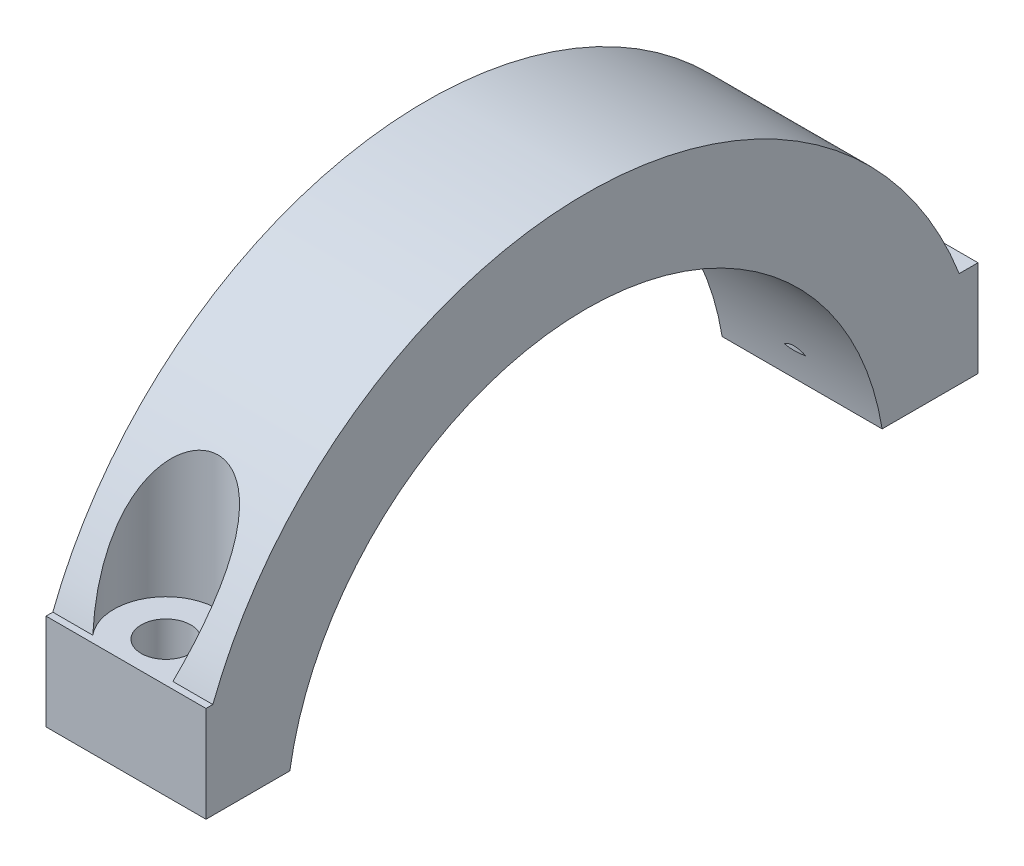
ISO-10303-21;
HEADER;
FILE_DESCRIPTION(('STEP AP214'),'2;1');
FILE_NAME('part.step','',(''),(''),'','','');
FILE_SCHEMA(('AUTOMOTIVE_DESIGN { 1 0 10303 214 1 1 1 1 }'));
ENDSEC;
DATA;
#1=APPLICATION_CONTEXT('core data for automotive mechanical design processes');
#2=APPLICATION_PROTOCOL_DEFINITION('international standard','automotive_design',2000,#1);
#3=PRODUCT_CONTEXT('',#1,'mechanical');
#4=PRODUCT('Part','Part','',(#3));
#5=PRODUCT_RELATED_PRODUCT_CATEGORY('part','',(#4));
#6=PRODUCT_DEFINITION_FORMATION('','',#4);
#7=PRODUCT_DEFINITION_CONTEXT('part definition',#1,'design');
#8=PRODUCT_DEFINITION('design','',#6,#7);
#9=PRODUCT_DEFINITION_SHAPE('','',#8);
#10=(LENGTH_UNIT() NAMED_UNIT(*) SI_UNIT(.MILLI.,.METRE.));
#11=(NAMED_UNIT(*) PLANE_ANGLE_UNIT() SI_UNIT($,.RADIAN.));
#12=(NAMED_UNIT(*) SI_UNIT($,.STERADIAN.) SOLID_ANGLE_UNIT());
#13=UNCERTAINTY_MEASURE_WITH_UNIT(LENGTH_MEASURE(1.E-05),#10,'distance_accuracy_value','');
#14=(GEOMETRIC_REPRESENTATION_CONTEXT(3) GLOBAL_UNCERTAINTY_ASSIGNED_CONTEXT((#13)) GLOBAL_UNIT_ASSIGNED_CONTEXT((#10,
#11,#12)) REPRESENTATION_CONTEXT('',''));
#15=CARTESIAN_POINT('',(0.,0.,0.));
#16=DIRECTION('',(0.,0.,1.));
#17=DIRECTION('',(1.,0.,0.));
#18=AXIS2_PLACEMENT_3D('',#15,#16,#17);
#19=CARTESIAN_POINT('',(10.,0.,0.));
#20=DIRECTION('',(-1.,0.,0.));
#21=DIRECTION('',(0.,0.,1.));
#22=AXIS2_PLACEMENT_3D('',#19,#20,#21);
#23=CYLINDRICAL_SURFACE('',#22,25.);
#24=CARTESIAN_POINT('',(10.,0.,0.));
#25=DIRECTION('',(1.,0.,0.));
#26=DIRECTION('',(0.,0.,-1.));
#27=AXIS2_PLACEMENT_3D('',#24,#25,#26);
#28=CIRCLE('',#27,25.);
#29=CARTESIAN_POINT('',(10.,9.,-23.3238075793812));
#30=VERTEX_POINT('',#29);
#31=CARTESIAN_POINT('',(10.,9.,23.3238075793812));
#32=VERTEX_POINT('',#31);
#33=EDGE_CURVE('E331',#30,#32,#28,.T.);
#34=ORIENTED_EDGE('',*,*,#33,.F.);
#35=DIRECTION('',(-1.,0.,0.));
#36=VECTOR('',#35,1.);
#37=CARTESIAN_POINT('',(10.,9.,-23.3238075793812));
#38=LINE('',#37,#36);
#39=CARTESIAN_POINT('',(7.50236330769557,9.,-23.3238075793812));
#40=VERTEX_POINT('',#39);
#41=EDGE_CURVE('E210',#30,#40,#38,.T.);
#42=ORIENTED_EDGE('',*,*,#41,.T.);
#43=CARTESIAN_POINT('',(4.8179541737619,5.,-24.4948974278318));
#44=CARTESIAN_POINT('',(4.76081893343102,5.015799687057,-24.4916749303125));
#45=CARTESIAN_POINT('',(4.70625032617648,5.03804380959396,-24.4871175037057));
#46=CARTESIAN_POINT('',(4.60304666483019,5.09138049343242,-24.476080569757));
#47=CARTESIAN_POINT('',(4.55431855556423,5.12229686174544,-24.4696392363716));
#48=CARTESIAN_POINT('',(4.4676572760741,5.18528728113686,-24.4563633080719));
#49=CARTESIAN_POINT('',(4.42915224960272,5.21665230735161,-24.4496967926973));
#50=CARTESIAN_POINT('',(4.35496575545927,5.28242853261864,-24.4355699195852));
#51=CARTESIAN_POINT('',(4.31928589095446,5.31684143808842,-24.4281091166712));
#52=CARTESIAN_POINT('',(4.24989155475177,5.38826694727591,-24.4124545033299));
#53=CARTESIAN_POINT('',(4.21620721306748,5.42530666267095,-24.4042526984261));
#54=CARTESIAN_POINT('',(4.15089711146283,5.50100370845183,-24.387301301042));
#55=CARTESIAN_POINT('',(4.1192706721346,5.53966049797171,-24.3785518912419));
#56=CARTESIAN_POINT('',(4.0326713545106,5.65017409686444,-24.3532515326744));
#57=CARTESIAN_POINT('',(3.97965619218647,5.72343537420826,-24.336148866591));
#58=CARTESIAN_POINT('',(3.877843681879,5.87253840253396,-24.3006005333444));
#59=CARTESIAN_POINT('',(3.82904907947786,5.9483817892038,-24.2821540061249));
#60=CARTESIAN_POINT('',(3.73471168555358,6.1019591274608,-24.244017116388));
#61=CARTESIAN_POINT('',(3.68917532248237,6.17969643171435,-24.2243244319692));
#62=CARTESIAN_POINT('',(3.60083616240648,6.3364235736066,-24.1838023652693));
#63=CARTESIAN_POINT('',(3.55803380122665,6.4154136084492,-24.1629728027361));
#64=CARTESIAN_POINT('',(3.43302805771781,6.65378342635454,-24.098842609992));
#65=CARTESIAN_POINT('',(3.3542496434421,6.81452324217029,-24.0539102879785));
#66=CARTESIAN_POINT('',(3.20377401609899,7.13782312205494,-23.9599630287263));
#67=CARTESIAN_POINT('',(3.13206880693255,7.30038089393126,-23.9109528197758));
#68=CARTESIAN_POINT('',(2.99478326580618,7.62605964005601,-23.8090783352451));
#69=CARTESIAN_POINT('',(2.92918025252555,7.78917598308968,-23.7562297484308));
#70=CARTESIAN_POINT('',(2.80317311137162,8.11607547116539,-23.6465441807424));
#71=CARTESIAN_POINT('',(2.7427692002064,8.27985864370439,-23.5897070337968));
#72=CARTESIAN_POINT('',(2.62681117418366,8.60786728763557,-23.4720047166962));
#73=CARTESIAN_POINT('',(2.57126116675686,8.77209301468836,-23.4111362102698));
#74=CARTESIAN_POINT('',(2.4649718436144,9.10057832692715,-23.2854120467091));
#75=CARTESIAN_POINT('',(2.414232832515,9.26483791359799,-23.2205561375337));
#76=CARTESIAN_POINT('',(2.26947097888056,9.75665103544227,-23.0202706188769));
#77=CARTESIAN_POINT('',(2.18265364672992,10.0839474200196,-22.8788697458168));
#78=CARTESIAN_POINT('',(2.02994371734763,10.7361118447252,-22.5801792128455));
#79=CARTESIAN_POINT('',(1.96404570753637,11.0609804917199,-22.4228936767722));
#80=CARTESIAN_POINT('',(1.87317504322328,11.6057735521635,-22.1442587717281));
#81=CARTESIAN_POINT('',(1.84184858387781,11.8267615959965,-22.0270430734251));
#82=CARTESIAN_POINT('',(1.79202045959561,12.2662701261295,-21.7853504064128));
#83=CARTESIAN_POINT('',(1.77352002656736,12.4847903734214,-21.660872741454));
#84=CARTESIAN_POINT('',(1.75116576161172,12.9184271222033,-21.4050829647093));
#85=CARTESIAN_POINT('',(1.74730387282165,13.1335454311279,-21.2737746527784));
#86=CARTESIAN_POINT('',(1.75646610423381,13.5594441094061,-21.0048760995575));
#87=CARTESIAN_POINT('',(1.76948414588575,13.7702260125602,-20.8672881368127));
#88=CARTESIAN_POINT('',(1.80819663256484,14.1223018514703,-20.6298535927575));
#89=CARTESIAN_POINT('',(1.82877954058078,14.265083049327,-20.5313719923732));
#90=CARTESIAN_POINT('',(1.88053127267533,14.5472723807822,-20.3324038314615));
#91=CARTESIAN_POINT('',(1.91169727508352,14.6866814028698,-20.2319178120683));
#92=CARTESIAN_POINT('',(1.98585352361947,14.9612155824143,-20.0297538432109));
#93=CARTESIAN_POINT('',(2.02882972798247,15.0963456159273,-19.9280774456389));
#94=CARTESIAN_POINT('',(2.12804368595833,15.3613937740365,-19.7244900783578));
#95=CARTESIAN_POINT('',(2.18427541697881,15.4913142343051,-19.6225792359292));
#96=CARTESIAN_POINT('',(2.33134482381242,15.7839579924979,-19.3884423951674));
#97=CARTESIAN_POINT('',(2.427506575166,15.944385681581,-19.2565979675356));
#98=CARTESIAN_POINT('',(2.64908345229502,16.2497897015913,-18.9995789427454));
#99=CARTESIAN_POINT('',(2.77445995688363,16.3947860668716,-18.8743958055958));
#100=CARTESIAN_POINT('',(3.02301692222405,16.63048680127,-18.6666906163922));
#101=CARTESIAN_POINT('',(3.13929344246469,16.7258127729032,-18.5812044799901));
#102=CARTESIAN_POINT('',(3.39077044054143,16.9004825025734,-18.4224746095768));
#103=CARTESIAN_POINT('',(3.52594534545203,16.9798475105445,-18.3492146204755));
#104=CARTESIAN_POINT('',(3.78692014431065,17.1053934308411,-18.2321554868964));
#105=CARTESIAN_POINT('',(3.90973386683244,17.1550054974992,-18.1854083810978));
#106=CARTESIAN_POINT('',(4.16501463806095,17.2385251969008,-18.1062579677654));
#107=CARTESIAN_POINT('',(4.29747642822116,17.2724413114654,-18.0738469136971));
#108=CARTESIAN_POINT('',(4.56946741726252,17.3227155931803,-18.0256699688536));
#109=CARTESIAN_POINT('',(4.70903115699582,17.3389771962439,-18.0099956297391));
#110=CARTESIAN_POINT('',(4.98992371574744,17.3524877673157,-17.9969795094397));
#111=CARTESIAN_POINT('',(5.13125202050612,17.3497421513263,-17.999632505981));
#112=CARTESIAN_POINT('',(5.39802452231626,17.3265654616312,-18.021940193726));
#113=CARTESIAN_POINT('',(5.52374908668077,17.307756715466,-18.0400351697968));
#114=CARTESIAN_POINT('',(5.76930335802011,17.2556549548985,-18.0898772815714));
#115=CARTESIAN_POINT('',(5.8891325822593,17.2223607565554,-18.1216255331972));
#116=CARTESIAN_POINT('',(6.1254321565203,17.1411758549476,-18.19844267422));
#117=CARTESIAN_POINT('',(6.24153908167591,17.0927212754214,-18.2440236515006));
#118=CARTESIAN_POINT('',(6.46313009828304,16.9838566039209,-18.3454125296047));
#119=CARTESIAN_POINT('',(6.56860863974196,16.9234403140291,-18.401225731104));
#120=CARTESIAN_POINT('',(6.82034546742972,16.7585154952757,-18.551824039023));
#121=CARTESIAN_POINT('',(6.95922321581167,16.6474331633245,-18.6517647421214));
#122=CARTESIAN_POINT('',(7.21146256512696,16.4080289064891,-18.8627181635097));
#123=CARTESIAN_POINT('',(7.32476175541971,16.2796660091261,-18.9737570294197));
#124=CARTESIAN_POINT('',(7.50140890674612,16.0453280690683,-19.1719739464897));
#125=CARTESIAN_POINT('',(7.57008943180606,15.9421882878598,-19.2578657915947));
#126=CARTESIAN_POINT('',(7.69565163355004,15.7302526176903,-19.4313638088107));
#127=CARTESIAN_POINT('',(7.75252758141504,15.6214540143567,-19.5189707908224));
#128=CARTESIAN_POINT('',(7.85555280060953,15.3992125793976,-19.6947799125714));
#129=CARTESIAN_POINT('',(7.90169175005019,15.2857654010998,-19.7829825418122));
#130=CARTESIAN_POINT('',(7.98420197122342,15.0551143621627,-19.9590734594733));
#131=CARTESIAN_POINT('',(8.02056990231848,14.9379092319989,-20.0469616302753));
#132=CARTESIAN_POINT('',(8.10438609962112,14.6263432393041,-20.2762742922633));
#133=CARTESIAN_POINT('',(8.14460386389037,14.429441500465,-20.4169103587425));
#134=CARTESIAN_POINT('',(8.20517834334414,14.0295402633217,-20.6937495375455));
#135=CARTESIAN_POINT('',(8.22552261886931,13.8265370276606,-20.8299498218386));
#136=CARTESIAN_POINT('',(8.2491693794963,13.4155113879238,-21.0970199996329));
#137=CARTESIAN_POINT('',(8.25243494342361,13.2074790857102,-21.2278777385091));
#138=CARTESIAN_POINT('',(8.24413582974539,12.7879229920149,-21.4832340570578));
#139=CARTESIAN_POINT('',(8.23257308036449,12.5763996580258,-21.607733461358));
#140=CARTESIAN_POINT('',(8.19981494072686,12.1899402809495,-21.8276259214967));
#141=CARTESIAN_POINT('',(8.18079090460287,12.0154557802179,-21.9241504620675));
#142=CARTESIAN_POINT('',(8.13493710981378,11.6650266643155,-22.1125927326782));
#143=CARTESIAN_POINT('',(8.10810641959751,11.4890818773274,-22.2045099113963));
#144=CARTESIAN_POINT('',(8.01692473320957,10.9592801998469,-22.4733388203973));
#145=CARTESIAN_POINT('',(7.94189907131117,10.6036170355238,-22.6432364390868));
#146=CARTESIAN_POINT('',(7.81098013029234,10.0683412530972,-22.8837687259433));
#147=CARTESIAN_POINT('',(7.76426269735578,9.88957295727559,-22.9615786296815));
#148=CARTESIAN_POINT('',(7.66494962209059,9.53165858494943,-23.1124462149902));
#149=CARTESIAN_POINT('',(7.61235437909835,9.35251253491973,-23.1855042188703));
#150=CARTESIAN_POINT('',(7.50147002469042,8.99423284161958,-23.3268267707743));
#151=CARTESIAN_POINT('',(7.44318429563631,8.81509925355147,-23.3950941253252));
#152=CARTESIAN_POINT('',(7.32085793481637,8.45707059128774,-23.5268852538021));
#153=CARTESIAN_POINT('',(7.25681800389272,8.27817549073138,-23.5904096036889));
#154=CARTESIAN_POINT('',(7.14806972735517,7.9886364860645,-23.6895642198018));
#155=CARTESIAN_POINT('',(7.10521921913053,7.87778919730984,-23.7266515213319));
#156=CARTESIAN_POINT('',(7.01703403057275,7.65648965006982,-23.7989855674335));
#157=CARTESIAN_POINT('',(6.97169952837906,7.54603736386048,-23.8342324436377));
#158=CARTESIAN_POINT('',(6.87852564048696,7.32616835424268,-23.9027290990438));
#159=CARTESIAN_POINT('',(6.83069773538432,7.21674922420519,-23.9359867386485));
#160=CARTESIAN_POINT('',(6.73203584968266,6.99872292444683,-24.0006417576529));
#161=CARTESIAN_POINT('',(6.68120202139338,6.89011571389967,-24.0320392311459));
#162=CARTESIAN_POINT('',(6.55870514638485,6.63843072049081,-24.1029770979384));
#163=CARTESIAN_POINT('',(6.48570116167712,6.49579590444245,-24.1417885363131));
#164=CARTESIAN_POINT('',(6.33096889126718,6.21255268903905,-24.2162291700021));
#165=CARTESIAN_POINT('',(6.24916577061185,6.07197548014668,-24.2518254067281));
#166=CARTESIAN_POINT('',(6.11681512965087,5.86480012044862,-24.3024550583595));
#167=CARTESIAN_POINT('',(6.07065204748312,5.7957814889986,-24.3190003796364));
#168=CARTESIAN_POINT('',(5.97442181337047,5.66025533508664,-24.3509001781065));
#169=CARTESIAN_POINT('',(5.92435666709164,5.59374654831505,-24.3662552590943));
#170=CARTESIAN_POINT('',(5.82011183375967,5.46575740069826,-24.3952805478376));
#171=CARTESIAN_POINT('',(5.76602973053315,5.40420495919124,-24.4089774679866));
#172=CARTESIAN_POINT('',(5.65139273614999,5.28716607485493,-24.4345951440499));
#173=CARTESIAN_POINT('',(5.5908541292471,5.2316650531603,-24.4465201950382));
#174=CARTESIAN_POINT('',(5.47503249694757,5.14203723706282,-24.4655073401719));
#175=CARTESIAN_POINT('',(5.42148724328357,5.1058893580318,-24.4730627291071));
#176=CARTESIAN_POINT('',(5.30719229636328,5.04367769947318,-24.4859639423739));
#177=CARTESIAN_POINT('',(5.24631020660289,5.01785281985034,-24.4912575965564));
#178=CARTESIAN_POINT('',(5.18204582623811,5.,-24.4948974278318));
#179=B_SPLINE_CURVE_WITH_KNOTS('',3,(#43,#44,#45,#46,#47,#48,#49,#50,#51,#52,#53,#54,#55,#56,
#57,#58,#59,#60,#61,#62,#63,#64,#65,#66,#67,#68,#69,#70,#71,#72,#73,#74,#75,#76,#77,#78,#79,#80,
#81,#82,#83,#84,#85,#86,#87,#88,#89,#90,#91,#92,#93,#94,#95,#96,#97,#98,#99,#100,#101,#102,#103,
#104,#105,#106,#107,#108,#109,#110,#111,#112,#113,#114,#115,#116,#117,#118,#119,#120,#121,#122,
#123,#124,#125,#126,#127,#128,#129,#130,#131,#132,#133,#134,#135,#136,#137,#138,#139,#140,#141,
#142,#143,#144,#145,#146,#147,#148,#149,#150,#151,#152,#153,#154,#155,#156,#157,#158,#159,#160,
#161,#162,#163,#164,#165,#166,#167,#168,#169,#170,#171,#172,#173,#174,#175,#176,#177,#178),
.UNSPECIFIED.,.F.,.F.,(4,2,2,2,2,2,2,2,2,2,2,2,2,2,2,2,2,2,2,2,2,2,2,2,2,2,2,2,2,2,2,2,2,2,2,2,
2,2,2,2,2,2,2,2,2,2,2,2,2,2,2,2,2,2,2,2,2,2,2,2,2,2,2,2,2,2,2,4),(0.,0.176719470672728,
0.350080496190037,0.50023389865411,0.650471905505099,0.802587236727575,0.954652090197377,
1.23053103990911,1.50658812697235,1.78317565289199,2.05980715991452,2.61321157306321,
3.16598302748914,3.71661009833964,4.26726010922962,4.81837166305008,5.3695180881499,
6.46943745490125,7.56907200063811,8.32500363320026,9.0810078610932,9.83659593371071,
10.5919119907041,11.1156039265753,11.6391563449039,12.1620889576976,12.6847844346577,
13.3692867983656,14.0528893496774,14.569978687277,15.0863749629,15.506050204339,
15.9254983949619,16.3472294402056,16.768840320457,17.152311500712,17.5358140291417,
17.9357348896056,18.3358635125118,18.9444335855547,19.5544728714349,20.0061942726775,
20.4581343865545,20.9105071893724,21.3630344587941,22.0977253658682,22.8328758530222,
23.5696149514217,24.3062582564294,24.9069626236949,25.5077387011332,26.709846446292,
27.3112096540794,27.9125320302674,28.5134991382982,29.1143931495446,29.4878418128252,
29.8612637292244,30.2330965371867,30.6049105205475,31.0993324285075,31.5983533373623,
31.8522557703126,32.1060285470097,32.3549234803407,32.6032048796666,32.7972852240189,
32.9956279230659),.UNSPECIFIED.);
#180=CARTESIAN_POINT('',(2.49763669230444,9.,-23.3238075793812));
#181=VERTEX_POINT('',#180);
#182=EDGE_CURVE('E322',#181,#40,#179,.T.);
#183=ORIENTED_EDGE('',*,*,#182,.F.);
#184=CARTESIAN_POINT('',(0.,9.,-23.3238075793812));
#185=VERTEX_POINT('',#184);
#186=EDGE_CURVE('E213',#181,#185,#38,.T.);
#187=ORIENTED_EDGE('',*,*,#186,.T.);
#188=CARTESIAN_POINT('',(0.,0.,0.));
#189=DIRECTION('',(1.,0.,0.));
#190=DIRECTION('',(0.,0.,-1.));
#191=AXIS2_PLACEMENT_3D('',#188,#189,#190);
#192=CIRCLE('',#191,25.);
#193=CARTESIAN_POINT('',(0.,9.,23.3238075793812));
#194=VERTEX_POINT('',#193);
#195=EDGE_CURVE('E326',#185,#194,#192,.T.);
#196=ORIENTED_EDGE('',*,*,#195,.T.);
#197=DIRECTION('',(-1.,0.,0.));
#198=VECTOR('',#197,1.);
#199=CARTESIAN_POINT('',(10.,9.,23.3238075793812));
#200=LINE('',#199,#198);
#201=CARTESIAN_POINT('',(2.49763669230444,9.,23.3238075793812));
#202=VERTEX_POINT('',#201);
#203=EDGE_CURVE('E198',#194,#202,#200,.F.);
#204=ORIENTED_EDGE('',*,*,#203,.T.);
#205=CARTESIAN_POINT('',(5.18204582623811,5.,24.4948974278318));
#206=CARTESIAN_POINT('',(5.23918106656899,5.015799687057,24.4916749303125));
#207=CARTESIAN_POINT('',(5.29374967382353,5.03804380959396,24.4871175037057));
#208=CARTESIAN_POINT('',(5.39695333516982,5.09138049343242,24.476080569757));
#209=CARTESIAN_POINT('',(5.44568144443578,5.12229686174544,24.4696392363716));
#210=CARTESIAN_POINT('',(5.53234272392591,5.18528728113686,24.4563633080719));
#211=CARTESIAN_POINT('',(5.57084775039729,5.21665230735161,24.4496967926973));
#212=CARTESIAN_POINT('',(5.64503424454074,5.28242853261864,24.4355699195852));
#213=CARTESIAN_POINT('',(5.68071410904555,5.31684143808842,24.4281091166712));
#214=CARTESIAN_POINT('',(5.75010844524824,5.38826694727591,24.4124545033299));
#215=CARTESIAN_POINT('',(5.78379278693253,5.42530666267095,24.4042526984261));
#216=CARTESIAN_POINT('',(5.84910288853718,5.50100370845183,24.387301301042));
#217=CARTESIAN_POINT('',(5.88072932786541,5.53966049797171,24.3785518912419));
#218=CARTESIAN_POINT('',(5.96732864548941,5.65017409686444,24.3532515326744));
#219=CARTESIAN_POINT('',(6.02034380781354,5.72343537420826,24.336148866591));
#220=CARTESIAN_POINT('',(6.12215631812101,5.87253840253396,24.3006005333444));
#221=CARTESIAN_POINT('',(6.17095092052215,5.9483817892038,24.2821540061249));
#222=CARTESIAN_POINT('',(6.26528831444643,6.1019591274608,24.244017116388));
#223=CARTESIAN_POINT('',(6.31082467751765,6.17969643171435,24.2243244319692));
#224=CARTESIAN_POINT('',(6.39916383759353,6.3364235736066,24.1838023652693));
#225=CARTESIAN_POINT('',(6.44196619877337,6.4154136084492,24.1629728027361));
#226=CARTESIAN_POINT('',(6.5669719422822,6.65378342635454,24.098842609992));
#227=CARTESIAN_POINT('',(6.64575035655791,6.81452324217029,24.0539102879785));
#228=CARTESIAN_POINT('',(6.79622598390102,7.13782312205494,23.9599630287263));
#229=CARTESIAN_POINT('',(6.86793119306746,7.30038089393126,23.9109528197758));
#230=CARTESIAN_POINT('',(7.00521673419383,7.62605964005601,23.8090783352451));
#231=CARTESIAN_POINT('',(7.07081974747446,7.78917598308969,23.7562297484308));
#232=CARTESIAN_POINT('',(7.19682688862839,8.1160754711654,23.6465441807424));
#233=CARTESIAN_POINT('',(7.25723079979361,8.27985864370439,23.5897070337967));
#234=CARTESIAN_POINT('',(7.37318882581635,8.60786728763557,23.4720047166962));
#235=CARTESIAN_POINT('',(7.42873883324315,8.77209301468836,23.4111362102698));
#236=CARTESIAN_POINT('',(7.53502815638561,9.10057832692715,23.2854120467091));
#237=CARTESIAN_POINT('',(7.58576716748501,9.26483791359799,23.2205561375337));
#238=CARTESIAN_POINT('',(7.73052902111945,9.75665103544227,23.0202706188769));
#239=CARTESIAN_POINT('',(7.81734635327009,10.0839474200196,22.8788697458168));
#240=CARTESIAN_POINT('',(7.97005628265238,10.7361118447252,22.5801792128455));
#241=CARTESIAN_POINT('',(8.03595429246364,11.0609804917199,22.4228936767722));
#242=CARTESIAN_POINT('',(8.12682495677673,11.6057735521635,22.1442587717281));
#243=CARTESIAN_POINT('',(8.1581514161222,11.8267615959965,22.0270430734251));
#244=CARTESIAN_POINT('',(8.2079795404044,12.2662701261295,21.7853504064128));
#245=CARTESIAN_POINT('',(8.22647997343265,12.4847903734214,21.660872741454));
#246=CARTESIAN_POINT('',(8.24883423838829,12.9184271222033,21.4050829647093));
#247=CARTESIAN_POINT('',(8.25269612717836,13.1335454311279,21.2737746527784));
#248=CARTESIAN_POINT('',(8.2435338957662,13.5594441094061,21.0048760995575));
#249=CARTESIAN_POINT('',(8.23051585411426,13.7702260125602,20.8672881368127));
#250=CARTESIAN_POINT('',(8.19180336743517,14.1223018514703,20.6298535927575));
#251=CARTESIAN_POINT('',(8.17122045941923,14.265083049327,20.5313719923732));
#252=CARTESIAN_POINT('',(8.11946872732468,14.5472723807822,20.3324038314615));
#253=CARTESIAN_POINT('',(8.08830272491649,14.6866814028698,20.2319178120683));
#254=CARTESIAN_POINT('',(8.01414647638054,14.9612155824143,20.0297538432109));
#255=CARTESIAN_POINT('',(7.97117027201754,15.0963456159273,19.9280774456389));
#256=CARTESIAN_POINT('',(7.87195631404168,15.3613937740365,19.7244900783577));
#257=CARTESIAN_POINT('',(7.8157245830212,15.4913142343051,19.6225792359292));
#258=CARTESIAN_POINT('',(7.66865517618759,15.7839579924979,19.3884423951674));
#259=CARTESIAN_POINT('',(7.57249342483401,15.944385681581,19.2565979675356));
#260=CARTESIAN_POINT('',(7.35091654770499,16.2497897015913,18.9995789427454));
#261=CARTESIAN_POINT('',(7.22554004311638,16.3947860668716,18.8743958055958));
#262=CARTESIAN_POINT('',(6.97698307777595,16.63048680127,18.6666906163922));
#263=CARTESIAN_POINT('',(6.86070655753531,16.7258127729032,18.5812044799901));
#264=CARTESIAN_POINT('',(6.60922955945858,16.9004825025734,18.4224746095768));
#265=CARTESIAN_POINT('',(6.47405465454798,16.9798475105445,18.3492146204755));
#266=CARTESIAN_POINT('',(6.21307985568936,17.1053934308411,18.2321554868964));
#267=CARTESIAN_POINT('',(6.09026613316757,17.1550054974992,18.1854083810978));
#268=CARTESIAN_POINT('',(5.83498536193906,17.2385251969008,18.1062579677654));
#269=CARTESIAN_POINT('',(5.70252357177886,17.2724413114654,18.0738469136971));
#270=CARTESIAN_POINT('',(5.43053258273749,17.3227155931803,18.0256699688536));
#271=CARTESIAN_POINT('',(5.29096884300419,17.3389771962439,18.0099956297391));
#272=CARTESIAN_POINT('',(5.01007628425257,17.3524877673157,17.9969795094397));
#273=CARTESIAN_POINT('',(4.86874797949389,17.3497421513263,17.999632505981));
#274=CARTESIAN_POINT('',(4.60197547768376,17.3265654616312,18.021940193726));
#275=CARTESIAN_POINT('',(4.47625091331925,17.307756715466,18.0400351697968));
#276=CARTESIAN_POINT('',(4.2306966419799,17.2556549548985,18.0898772815714));
#277=CARTESIAN_POINT('',(4.11086741774072,17.2223607565554,18.1216255331972));
#278=CARTESIAN_POINT('',(3.87456784347972,17.1411758549476,18.19844267422));
#279=CARTESIAN_POINT('',(3.7584609183241,17.0927212754214,18.2440236515006));
#280=CARTESIAN_POINT('',(3.53686990171698,16.9838566039209,18.3454125296047));
#281=CARTESIAN_POINT('',(3.43139136025805,16.9234403140291,18.401225731104));
#282=CARTESIAN_POINT('',(3.17965453257029,16.7585154952757,18.551824039023));
#283=CARTESIAN_POINT('',(3.04077678418834,16.6474331633245,18.6517647421214));
#284=CARTESIAN_POINT('',(2.78853743487306,16.4080289064891,18.8627181635097));
#285=CARTESIAN_POINT('',(2.6752382445803,16.2796660091261,18.9737570294197));
#286=CARTESIAN_POINT('',(2.4985910932539,16.0453280690683,19.1719739464897));
#287=CARTESIAN_POINT('',(2.42991056819395,15.9421882878598,19.2578657915947));
#288=CARTESIAN_POINT('',(2.30434836644998,15.7302526176903,19.4313638088107));
#289=CARTESIAN_POINT('',(2.24747241858498,15.6214540143567,19.5189707908224));
#290=CARTESIAN_POINT('',(2.14444719939048,15.3992125793976,19.6947799125714));
#291=CARTESIAN_POINT('',(2.09830824994982,15.2857654010998,19.7829825418122));
#292=CARTESIAN_POINT('',(2.01579802877659,15.0551143621627,19.9590734594733));
#293=CARTESIAN_POINT('',(1.97943009768153,14.9379092319989,20.0469616302753));
#294=CARTESIAN_POINT('',(1.89561390037889,14.6263432393041,20.2762742922633));
#295=CARTESIAN_POINT('',(1.85539613610964,14.429441500465,20.4169103587425));
#296=CARTESIAN_POINT('',(1.79482165665587,14.0295402633217,20.6937495375455));
#297=CARTESIAN_POINT('',(1.7744773811307,13.8265370276606,20.8299498218386));
#298=CARTESIAN_POINT('',(1.7508306205037,13.4155113879238,21.0970199996329));
#299=CARTESIAN_POINT('',(1.74756505657641,13.2074790857102,21.2278777385091));
#300=CARTESIAN_POINT('',(1.75586417025462,12.7879229920149,21.4832340570578));
#301=CARTESIAN_POINT('',(1.76742691963552,12.5763996580258,21.607733461358));
#302=CARTESIAN_POINT('',(1.80018505927315,12.1899402809495,21.8276259214967));
#303=CARTESIAN_POINT('',(1.81920909539714,12.0154557802179,21.9241504620674));
#304=CARTESIAN_POINT('',(1.86506289018623,11.6650266643155,22.1125927326782));
#305=CARTESIAN_POINT('',(1.8918935804025,11.4890818773274,22.2045099113963));
#306=CARTESIAN_POINT('',(1.98307526679044,10.9592801998469,22.4733388203973));
#307=CARTESIAN_POINT('',(2.05810092868883,10.6036170355238,22.6432364390868));
#308=CARTESIAN_POINT('',(2.18901986970766,10.0683412530972,22.8837687259433));
#309=CARTESIAN_POINT('',(2.23573730264423,9.88957295727561,22.9615786296815));
#310=CARTESIAN_POINT('',(2.33505037790942,9.53165858494945,23.1124462149902));
#311=CARTESIAN_POINT('',(2.38764562090166,9.35251253491975,23.1855042188703));
#312=CARTESIAN_POINT('',(2.49852997530958,8.9942328416196,23.3268267707743));
#313=CARTESIAN_POINT('',(2.5568157043637,8.8150992535515,23.3950941253252));
#314=CARTESIAN_POINT('',(2.67914206518364,8.45707059128777,23.5268852538021));
#315=CARTESIAN_POINT('',(2.74318199610729,8.2781754907314,23.5904096036889));
#316=CARTESIAN_POINT('',(2.85193027264484,7.98863648606453,23.6895642198017));
#317=CARTESIAN_POINT('',(2.89478078086947,7.87778919730986,23.7266515213319));
#318=CARTESIAN_POINT('',(2.98296596942725,7.65648965006984,23.7989855674335));
#319=CARTESIAN_POINT('',(3.02830047162094,7.5460373638605,23.8342324436377));
#320=CARTESIAN_POINT('',(3.12147435951303,7.3261683542427,23.9027290990438));
#321=CARTESIAN_POINT('',(3.16930226461567,7.21674922420521,23.9359867386485));
#322=CARTESIAN_POINT('',(3.26796415031733,6.99872292444684,24.0006417576529));
#323=CARTESIAN_POINT('',(3.31879797860662,6.89011571389969,24.0320392311459));
#324=CARTESIAN_POINT('',(3.44129485361516,6.63843072049082,24.1029770979384));
#325=CARTESIAN_POINT('',(3.51429883832288,6.49579590444246,24.1417885363131));
#326=CARTESIAN_POINT('',(3.66903110873282,6.21255268903906,24.2162291700021));
#327=CARTESIAN_POINT('',(3.75083422938815,6.07197548014669,24.2518254067281));
#328=CARTESIAN_POINT('',(3.88318487034913,5.86480012044862,24.3024550583595));
#329=CARTESIAN_POINT('',(3.92934795251689,5.7957814889986,24.3190003796364));
#330=CARTESIAN_POINT('',(4.02557818662954,5.66025533508665,24.3509001781065));
#331=CARTESIAN_POINT('',(4.07564333290837,5.59374654831506,24.3662552590943));
#332=CARTESIAN_POINT('',(4.17988816624033,5.46575740069826,24.3952805478376));
#333=CARTESIAN_POINT('',(4.23397026946685,5.40420495919123,24.4089774679866));
#334=CARTESIAN_POINT('',(4.34860726385002,5.28716607485493,24.4345951440499));
#335=CARTESIAN_POINT('',(4.40914587075291,5.2316650531603,24.4465201950382));
#336=CARTESIAN_POINT('',(4.52496750305244,5.14203723706282,24.4655073401719));
#337=CARTESIAN_POINT('',(4.57851275671644,5.1058893580318,24.4730627291071));
#338=CARTESIAN_POINT('',(4.69280770363673,5.04367769947318,24.4859639423739));
#339=CARTESIAN_POINT('',(4.75368979339711,5.01785281985033,24.4912575965564));
#340=CARTESIAN_POINT('',(4.81795417376189,4.99999999999999,24.4948974278318));
#341=B_SPLINE_CURVE_WITH_KNOTS('',3,(#205,#206,#207,#208,#209,#210,#211,#212,#213,#214,#215,
#216,#217,#218,#219,#220,#221,#222,#223,#224,#225,#226,#227,#228,#229,#230,#231,#232,#233,#234,
#235,#236,#237,#238,#239,#240,#241,#242,#243,#244,#245,#246,#247,#248,#249,#250,#251,#252,#253,
#254,#255,#256,#257,#258,#259,#260,#261,#262,#263,#264,#265,#266,#267,#268,#269,#270,#271,#272,
#273,#274,#275,#276,#277,#278,#279,#280,#281,#282,#283,#284,#285,#286,#287,#288,#289,#290,#291,
#292,#293,#294,#295,#296,#297,#298,#299,#300,#301,#302,#303,#304,#305,#306,#307,#308,#309,#310,
#311,#312,#313,#314,#315,#316,#317,#318,#319,#320,#321,#322,#323,#324,#325,#326,#327,#328,#329,
#330,#331,#332,#333,#334,#335,#336,#337,#338,#339,#340),.UNSPECIFIED.,.F.,.F.,(4,2,2,2,2,2,2,2,
2,2,2,2,2,2,2,2,2,2,2,2,2,2,2,2,2,2,2,2,2,2,2,2,2,2,2,2,2,2,2,2,2,2,2,2,2,2,2,2,2,2,2,2,2,2,2,2,
2,2,2,2,2,2,2,2,2,2,2,4),(0.,0.176719470672728,0.350080496190037,0.50023389865411,
0.650471905505099,0.802587236727575,0.954652090197377,1.23053103990911,1.50658812697235,
1.78317565289199,2.05980715991452,2.61321157306321,3.16598302748914,3.71661009833964,
4.26726010922962,4.81837166305008,5.3695180881499,6.46943745490125,7.56907200063811,
8.32500363320026,9.0810078610932,9.83659593371071,10.5919119907041,11.1156039265753,
11.6391563449039,12.1620889576977,12.6847844346577,13.3692867983656,14.0528893496775,
14.569978687277,15.0863749629,15.506050204339,15.9254983949619,16.3472294402056,16.768840320457,
17.152311500712,17.5358140291417,17.9357348896056,18.3358635125118,18.9444335855547,
19.5544728714349,20.0061942726775,20.4581343865544,20.9105071893724,21.3630344587941,
22.0977253658682,22.8328758530222,23.5696149514217,24.3062582564294,24.9069626236949,
25.5077387011331,26.709846446292,27.3112096540794,27.9125320302674,28.5134991382981,
29.1143931495445,29.4878418128252,29.8612637292244,30.2330965371867,30.6049105205475,
31.0993324285075,31.5983533373622,31.8522557703126,32.1060285470097,32.3549234803407,
32.6032048796667,32.7972852240189,32.995627923066),.UNSPECIFIED.);
#342=CARTESIAN_POINT('',(7.50236330769557,9.,23.3238075793812));
#343=VERTEX_POINT('',#342);
#344=EDGE_CURVE('E271',#343,#202,#341,.T.);
#345=ORIENTED_EDGE('',*,*,#344,.F.);
#346=EDGE_CURVE('E203',#343,#32,#200,.F.);
#347=ORIENTED_EDGE('',*,*,#346,.T.);
#348=EDGE_LOOP('',(#34,#42,#183,#187,#196,#204,#345,#347));
#349=FACE_BOUND('',#348,.T.);
#350=ADVANCED_FACE('F49',(#349),#23,.T.);
#351=CARTESIAN_POINT('',(10.,0.,0.));
#352=DIRECTION('',(1.,0.,0.));
#353=DIRECTION('',(0.,0.,-1.));
#354=AXIS2_PLACEMENT_3D('',#351,#352,#353);
#355=PLANE('',#354);
#356=DIRECTION('',(0.,1.,0.));
#357=VECTOR('',#356,1.);
#358=CARTESIAN_POINT('',(10.,11.9381131767659,23.75));
#359=LINE('',#358,#357);
#360=CARTESIAN_POINT('',(10.,3.,23.75));
#361=VERTEX_POINT('',#360);
#362=CARTESIAN_POINT('',(10.,9.,23.75));
#363=VERTEX_POINT('',#362);
#364=EDGE_CURVE('E65',#361,#363,#359,.T.);
#365=ORIENTED_EDGE('',*,*,#364,.F.);
#366=DIRECTION('',(0.,0.,-1.));
#367=VECTOR('',#366,1.);
#368=CARTESIAN_POINT('',(10.,3.,0.));
#369=LINE('',#368,#367);
#370=CARTESIAN_POINT('',(10.,3.,18.5084440188796));
#371=VERTEX_POINT('',#370);
#372=EDGE_CURVE('E152',#361,#371,#369,.T.);
#373=ORIENTED_EDGE('',*,*,#372,.T.);
#374=CARTESIAN_POINT('',(10.,0.,0.));
#375=DIRECTION('',(-1.,0.,0.));
#376=DIRECTION('',(0.,0.,-1.));
#377=AXIS2_PLACEMENT_3D('',#374,#375,#376);
#378=CIRCLE('',#377,18.75);
#379=CARTESIAN_POINT('',(10.,3.,-18.5084440188796));
#380=VERTEX_POINT('',#379);
#381=EDGE_CURVE('E291',#371,#380,#378,.T.);
#382=ORIENTED_EDGE('',*,*,#381,.T.);
#383=CARTESIAN_POINT('',(10.,3.,-24.5));
#384=VERTEX_POINT('',#383);
#385=EDGE_CURVE('E167',#380,#384,#369,.T.);
#386=ORIENTED_EDGE('',*,*,#385,.T.);
#387=DIRECTION('',(0.,-1.,0.));
#388=VECTOR('',#387,1.);
#389=CARTESIAN_POINT('',(10.,20.657561626468,-24.5));
#390=LINE('',#389,#388);
#391=CARTESIAN_POINT('',(10.,9.,-24.5));
#392=VERTEX_POINT('',#391);
#393=EDGE_CURVE('E73',#392,#384,#390,.T.);
#394=ORIENTED_EDGE('',*,*,#393,.F.);
#395=DIRECTION('',(0.,0.,1.));
#396=VECTOR('',#395,1.);
#397=CARTESIAN_POINT('',(10.,9.,-18.5084440188796));
#398=LINE('',#397,#396);
#399=EDGE_CURVE('E223',#392,#30,#398,.T.);
#400=ORIENTED_EDGE('',*,*,#399,.T.);
#401=ORIENTED_EDGE('',*,*,#33,.T.);
#402=DIRECTION('',(0.,0.,1.));
#403=VECTOR('',#402,1.);
#404=CARTESIAN_POINT('',(10.,9.,18.5084440188796));
#405=LINE('',#404,#403);
#406=EDGE_CURVE('E155',#32,#363,#405,.T.);
#407=ORIENTED_EDGE('',*,*,#406,.T.);
#408=EDGE_LOOP('',(#365,#373,#382,#386,#394,#400,#401,#407));
#409=FACE_BOUND('',#408,.T.);
#410=ADVANCED_FACE('F150',(#409),#355,.T.);
#411=CARTESIAN_POINT('',(0.,0.,0.));
#412=DIRECTION('',(1.,0.,0.));
#413=DIRECTION('',(0.,0.,-1.));
#414=AXIS2_PLACEMENT_3D('',#411,#412,#413);
#415=PLANE('',#414);
#416=DIRECTION('',(0.,0.,-1.));
#417=VECTOR('',#416,1.);
#418=CARTESIAN_POINT('',(0.,3.,0.));
#419=LINE('',#418,#417);
#420=CARTESIAN_POINT('',(0.,3.,23.75));
#421=VERTEX_POINT('',#420);
#422=CARTESIAN_POINT('',(0.,3.,18.5084440188796));
#423=VERTEX_POINT('',#422);
#424=EDGE_CURVE('E165',#421,#423,#419,.T.);
#425=ORIENTED_EDGE('',*,*,#424,.F.);
#426=DIRECTION('',(0.,1.,0.));
#427=VECTOR('',#426,1.);
#428=CARTESIAN_POINT('',(0.,11.9381131767659,23.75));
#429=LINE('',#428,#427);
#430=CARTESIAN_POINT('',(0.,9.,23.75));
#431=VERTEX_POINT('',#430);
#432=EDGE_CURVE('E141',#421,#431,#429,.T.);
#433=ORIENTED_EDGE('',*,*,#432,.T.);
#434=DIRECTION('',(0.,0.,-1.));
#435=VECTOR('',#434,1.);
#436=CARTESIAN_POINT('',(0.,9.,18.5084440188796));
#437=LINE('',#436,#435);
#438=EDGE_CURVE('E207',#431,#194,#437,.T.);
#439=ORIENTED_EDGE('',*,*,#438,.T.);
#440=ORIENTED_EDGE('',*,*,#195,.F.);
#441=DIRECTION('',(0.,0.,-1.));
#442=VECTOR('',#441,1.);
#443=CARTESIAN_POINT('',(0.,9.,-18.5084440188796));
#444=LINE('',#443,#442);
#445=CARTESIAN_POINT('',(0.,9.,-24.5));
#446=VERTEX_POINT('',#445);
#447=EDGE_CURVE('E220',#185,#446,#444,.T.);
#448=ORIENTED_EDGE('',*,*,#447,.T.);
#449=DIRECTION('',(0.,-1.,0.));
#450=VECTOR('',#449,1.);
#451=CARTESIAN_POINT('',(0.,20.657561626468,-24.5));
#452=LINE('',#451,#450);
#453=CARTESIAN_POINT('',(0.,3.,-24.5));
#454=VERTEX_POINT('',#453);
#455=EDGE_CURVE('E217',#446,#454,#452,.T.);
#456=ORIENTED_EDGE('',*,*,#455,.T.);
#457=CARTESIAN_POINT('',(0.,3.,-18.5084440188796));
#458=VERTEX_POINT('',#457);
#459=EDGE_CURVE('E174',#458,#454,#419,.T.);
#460=ORIENTED_EDGE('',*,*,#459,.F.);
#461=CARTESIAN_POINT('',(0.,0.,0.));
#462=DIRECTION('',(-1.,0.,0.));
#463=DIRECTION('',(0.,0.,-1.));
#464=AXIS2_PLACEMENT_3D('',#461,#462,#463);
#465=CIRCLE('',#464,18.75);
#466=EDGE_CURVE('E275',#423,#458,#465,.T.);
#467=ORIENTED_EDGE('',*,*,#466,.F.);
#468=EDGE_LOOP('',(#425,#433,#439,#440,#448,#456,#460,#467));
#469=FACE_BOUND('',#468,.T.);
#470=ADVANCED_FACE('F247',(#469),#415,.F.);
#471=CARTESIAN_POINT('',(10.,0.,0.));
#472=DIRECTION('',(-1.,0.,0.));
#473=DIRECTION('',(0.,0.,1.));
#474=AXIS2_PLACEMENT_3D('',#471,#472,#473);
#475=CYLINDRICAL_SURFACE('',#474,18.75);
#476=CARTESIAN_POINT('',(5.6758074143578,5.,-18.0710403685012));
#477=CARTESIAN_POINT('',(5.6292601037422,5.0357896180927,-18.061140641114));
#478=CARTESIAN_POINT('',(5.58036591084464,5.06905101030899,-18.0518199266114));
#479=CARTESIAN_POINT('',(5.47768611557139,5.12902222368507,-18.0348715530385));
#480=CARTESIAN_POINT('',(5.42384964075826,5.15565017989653,-18.0272651503065));
#481=CARTESIAN_POINT('',(5.31179114591544,5.20009034575069,-18.0144972703408));
#482=CARTESIAN_POINT('',(5.25353964684863,5.21783592721152,-18.0093542836187));
#483=CARTESIAN_POINT('',(5.13490311128236,5.24225169587907,-18.0022628253612));
#484=CARTESIAN_POINT('',(5.07453455686441,5.24899369656731,-18.0002936414638));
#485=CARTESIAN_POINT('',(4.95966172282164,5.25070712522981,-17.9997936318099));
#486=CARTESIAN_POINT('',(4.90517297462663,5.24678528401204,-18.0009395111113));
#487=CARTESIAN_POINT('',(4.79745095385238,5.22985147362062,-18.0058665431655));
#488=CARTESIAN_POINT('',(4.74422687054686,5.21678655699713,-18.0096630453441));
#489=CARTESIAN_POINT('',(4.62516988450938,5.17757749882327,-18.0209797204314));
#490=CARTESIAN_POINT('',(4.56034034297991,5.14868656170553,-18.0292749977537));
#491=CARTESIAN_POINT('',(4.4372865330236,5.0809609416335,-18.0484786971684));
#492=CARTESIAN_POINT('',(4.37900411154485,5.04222578848346,-18.0593608969406));
#493=CARTESIAN_POINT('',(4.32419258564221,5.00000000000001,-18.0710403685012));
#494=B_SPLINE_CURVE_WITH_KNOTS('',3,(#476,#477,#478,#479,#480,#481,#482,#483,#484,#485,#486,
#487,#488,#489,#490,#491,#492,#493),.UNSPECIFIED.,.F.,.F.,(4,2,2,2,2,2,2,2,4),(0.,
0.178869410581115,0.35984765385782,0.542163829551158,0.723285313401813,0.8863451495461,
1.05035716245229,1.26353744938003,1.47464264052816),.UNSPECIFIED.);
#495=CARTESIAN_POINT('',(5.6758074143578,5.,-18.0710403685012));
#496=VERTEX_POINT('',#495);
#497=CARTESIAN_POINT('',(4.32419258564221,5.,-18.0710403685012));
#498=VERTEX_POINT('',#497);
#499=EDGE_CURVE('E311',#496,#498,#494,.T.);
#500=ORIENTED_EDGE('',*,*,#499,.F.);
#501=DIRECTION('',(-1.,0.,0.));
#502=VECTOR('',#501,1.);
#503=CARTESIAN_POINT('',(10.,5.,-18.0710403685012));
#504=LINE('',#503,#502);
#505=EDGE_CURVE('E164',#498,#496,#504,.F.);
#506=ORIENTED_EDGE('',*,*,#505,.F.);
#507=EDGE_LOOP('',(#500,#506));
#508=FACE_BOUND('',#507,.T.);
#509=CARTESIAN_POINT('',(4.32419258564221,5.,18.0710403685012));
#510=CARTESIAN_POINT('',(4.37073989625781,5.0357896180927,18.061140641114));
#511=CARTESIAN_POINT('',(4.41963408915537,5.06905101030899,18.0518199266114));
#512=CARTESIAN_POINT('',(4.52231388442862,5.12902222368507,18.0348715530385));
#513=CARTESIAN_POINT('',(4.57615035924175,5.15565017989653,18.0272651503065));
#514=CARTESIAN_POINT('',(4.68820885408457,5.20009034575069,18.0144972703408));
#515=CARTESIAN_POINT('',(4.74646035315138,5.21783592721152,18.0093542836187));
#516=CARTESIAN_POINT('',(4.86509688871765,5.24225169587907,18.0022628253612));
#517=CARTESIAN_POINT('',(4.9254654431356,5.24899369656731,18.0002936414638));
#518=CARTESIAN_POINT('',(5.04033827717837,5.25070712522981,17.9997936318099));
#519=CARTESIAN_POINT('',(5.09482702537338,5.24678528401204,18.0009395111113));
#520=CARTESIAN_POINT('',(5.20254904614763,5.22985147362062,18.0058665431655));
#521=CARTESIAN_POINT('',(5.25577312945315,5.21678655699713,18.0096630453441));
#522=CARTESIAN_POINT('',(5.37483011549063,5.17757749882327,18.0209797204314));
#523=CARTESIAN_POINT('',(5.4396596570201,5.14868656170553,18.0292749977537));
#524=CARTESIAN_POINT('',(5.56271346697641,5.0809609416335,18.0484786971684));
#525=CARTESIAN_POINT('',(5.62099588845516,5.04222578848346,18.0593608969406));
#526=CARTESIAN_POINT('',(5.6758074143578,5.00000000000001,18.0710403685012));
#527=B_SPLINE_CURVE_WITH_KNOTS('',3,(#509,#510,#511,#512,#513,#514,#515,#516,#517,#518,#519,
#520,#521,#522,#523,#524,#525,#526),.UNSPECIFIED.,.F.,.F.,(4,2,2,2,2,2,2,2,4),(0.,
0.178869410581115,0.35984765385782,0.542163829551158,0.723285313401813,0.886345149546102,
1.05035716245229,1.26353744938003,1.47464264052816),.UNSPECIFIED.);
#528=CARTESIAN_POINT('',(4.32419258564221,5.,18.0710403685012));
#529=VERTEX_POINT('',#528);
#530=CARTESIAN_POINT('',(5.6758074143578,5.,18.0710403685012));
#531=VERTEX_POINT('',#530);
#532=EDGE_CURVE('E276',#529,#531,#527,.T.);
#533=ORIENTED_EDGE('',*,*,#532,.F.);
#534=DIRECTION('',(-1.,0.,0.));
#535=VECTOR('',#534,1.);
#536=CARTESIAN_POINT('',(10.,5.,18.0710403685012));
#537=LINE('',#536,#535);
#538=EDGE_CURVE('E171',#531,#529,#537,.T.);
#539=ORIENTED_EDGE('',*,*,#538,.F.);
#540=EDGE_LOOP('',(#533,#539));
#541=FACE_BOUND('',#540,.T.);
#542=DIRECTION('',(-1.,0.,0.));
#543=VECTOR('',#542,1.);
#544=CARTESIAN_POINT('',(10.,3.,18.5084440188796));
#545=LINE('',#544,#543);
#546=EDGE_CURVE('E161',#423,#371,#545,.F.);
#547=ORIENTED_EDGE('',*,*,#546,.F.);
#548=ORIENTED_EDGE('',*,*,#466,.T.);
#549=DIRECTION('',(-1.,0.,0.));
#550=VECTOR('',#549,1.);
#551=CARTESIAN_POINT('',(10.,3.,-18.5084440188796));
#552=LINE('',#551,#550);
#553=EDGE_CURVE('E181',#380,#458,#552,.T.);
#554=ORIENTED_EDGE('',*,*,#553,.F.);
#555=ORIENTED_EDGE('',*,*,#381,.F.);
#556=EDGE_LOOP('',(#547,#548,#554,#555));
#557=FACE_BOUND('',#556,.T.);
#558=ADVANCED_FACE('F51',(#508,#541,#557),#475,.F.);
#559=CARTESIAN_POINT('',(5.00000000000001,25.,-21.25));
#560=DIRECTION('',(0.,-1.,0.));
#561=DIRECTION('',(0.,0.,-1.));
#562=AXIS2_PLACEMENT_3D('',#559,#560,#561);
#563=CYLINDRICAL_SURFACE('',#562,3.25);
#564=CARTESIAN_POINT('',(5.00000000000001,9.,-21.25));
#565=DIRECTION('',(0.,1.,0.));
#566=DIRECTION('',(0.,0.,1.));
#567=AXIS2_PLACEMENT_3D('',#564,#565,#566);
#568=CIRCLE('',#567,3.25);
#569=EDGE_CURVE('E59',#181,#40,#568,.T.);
#570=ORIENTED_EDGE('',*,*,#569,.F.);
#571=ORIENTED_EDGE('',*,*,#182,.T.);
#572=EDGE_LOOP('',(#570,#571));
#573=FACE_BOUND('',#572,.T.);
#574=ADVANCED_FACE('F301',(#573),#563,.F.);
#575=CARTESIAN_POINT('',(5.00000000000001,25.,21.25));
#576=DIRECTION('',(0.,-1.,0.));
#577=DIRECTION('',(0.,0.,-1.));
#578=AXIS2_PLACEMENT_3D('',#575,#576,#577);
#579=CYLINDRICAL_SURFACE('',#578,3.25);
#580=CARTESIAN_POINT('',(5.00000000000001,9.,21.25));
#581=DIRECTION('',(0.,1.,0.));
#582=DIRECTION('',(0.,0.,1.));
#583=AXIS2_PLACEMENT_3D('',#580,#581,#582);
#584=CIRCLE('',#583,3.25);
#585=EDGE_CURVE('E191',#343,#202,#584,.T.);
#586=ORIENTED_EDGE('',*,*,#585,.F.);
#587=ORIENTED_EDGE('',*,*,#344,.T.);
#588=EDGE_LOOP('',(#586,#587));
#589=FACE_BOUND('',#588,.T.);
#590=ADVANCED_FACE('F295',(#589),#579,.F.);
#591=CARTESIAN_POINT('',(0.,3.,0.));
#592=DIRECTION('',(0.,-1.,0.));
#593=DIRECTION('',(0.,0.,-1.));
#594=AXIS2_PLACEMENT_3D('',#591,#592,#593);
#595=PLANE('',#594);
#596=DIRECTION('',(-1.,0.,0.));
#597=VECTOR('',#596,1.);
#598=CARTESIAN_POINT('',(0.,3.,-24.5));
#599=LINE('',#598,#597);
#600=EDGE_CURVE('E146',#384,#454,#599,.T.);
#601=ORIENTED_EDGE('',*,*,#600,.F.);
#602=ORIENTED_EDGE('',*,*,#385,.F.);
#603=ORIENTED_EDGE('',*,*,#553,.T.);
#604=ORIENTED_EDGE('',*,*,#459,.T.);
#605=EDGE_LOOP('',(#601,#602,#603,#604));
#606=FACE_BOUND('',#605,.T.);
#607=CARTESIAN_POINT('',(5.00000000000001,3.,-21.25));
#608=DIRECTION('',(0.,1.,0.));
#609=DIRECTION('',(0.,0.,1.));
#610=AXIS2_PLACEMENT_3D('',#607,#608,#609);
#611=CIRCLE('',#610,1.55);
#612=CARTESIAN_POINT('',(5.00000000000001,3.,-19.7));
#613=VERTEX_POINT('',#612);
#614=EDGE_CURVE('E237',#613,#613,#611,.T.);
#615=ORIENTED_EDGE('',*,*,#614,.T.);
#616=EDGE_LOOP('',(#615));
#617=FACE_BOUND('',#616,.T.);
#618=ADVANCED_FACE('F300',(#606,#617),#595,.T.);
#619=DIRECTION('',(1.,0.,0.));
#620=VECTOR('',#619,1.);
#621=CARTESIAN_POINT('',(0.,3.,23.75));
#622=LINE('',#621,#620);
#623=EDGE_CURVE('E138',#421,#361,#622,.T.);
#624=ORIENTED_EDGE('',*,*,#623,.F.);
#625=ORIENTED_EDGE('',*,*,#424,.T.);
#626=ORIENTED_EDGE('',*,*,#546,.T.);
#627=ORIENTED_EDGE('',*,*,#372,.F.);
#628=EDGE_LOOP('',(#624,#625,#626,#627));
#629=FACE_BOUND('',#628,.T.);
#630=CARTESIAN_POINT('',(5.00000000000001,3.,21.25));
#631=DIRECTION('',(0.,1.,0.));
#632=DIRECTION('',(0.,0.,1.));
#633=AXIS2_PLACEMENT_3D('',#630,#631,#632);
#634=CIRCLE('',#633,1.55);
#635=CARTESIAN_POINT('',(5.00000000000001,3.,22.8));
#636=VERTEX_POINT('',#635);
#637=EDGE_CURVE('E233',#636,#636,#634,.T.);
#638=ORIENTED_EDGE('',*,*,#637,.T.);
#639=EDGE_LOOP('',(#638));
#640=FACE_BOUND('',#639,.T.);
#641=ADVANCED_FACE('F158',(#629,#640),#595,.T.);
#642=CARTESIAN_POINT('',(5.00000000000001,9.,-21.25));
#643=DIRECTION('',(0.,1.,0.));
#644=DIRECTION('',(0.,0.,1.));
#645=AXIS2_PLACEMENT_3D('',#642,#643,#644);
#646=PLANE('',#645);
#647=CARTESIAN_POINT('',(5.00000000000001,9.,-21.25));
#648=DIRECTION('',(0.,1.,0.));
#649=DIRECTION('',(0.,0.,1.));
#650=AXIS2_PLACEMENT_3D('',#647,#648,#649);
#651=CIRCLE('',#650,1.55);
#652=CARTESIAN_POINT('',(5.00000000000001,9.,-19.7));
#653=VERTEX_POINT('',#652);
#654=EDGE_CURVE('E232',#653,#653,#651,.T.);
#655=ORIENTED_EDGE('',*,*,#654,.F.);
#656=EDGE_LOOP('',(#655));
#657=FACE_BOUND('',#656,.T.);
#658=ORIENTED_EDGE('',*,*,#569,.T.);
#659=ORIENTED_EDGE('',*,*,#41,.F.);
#660=ORIENTED_EDGE('',*,*,#399,.F.);
#661=DIRECTION('',(1.,0.,0.));
#662=VECTOR('',#661,1.);
#663=CARTESIAN_POINT('',(0.,9.,-24.5));
#664=LINE('',#663,#662);
#665=EDGE_CURVE('E224',#446,#392,#664,.T.);
#666=ORIENTED_EDGE('',*,*,#665,.F.);
#667=ORIENTED_EDGE('',*,*,#447,.F.);
#668=ORIENTED_EDGE('',*,*,#186,.F.);
#669=EDGE_LOOP('',(#658,#659,#660,#666,#667,#668));
#670=FACE_BOUND('',#669,.T.);
#671=ADVANCED_FACE('F364',(#657,#670),#646,.T.);
#672=CARTESIAN_POINT('',(5.00000000000001,9.,-21.25));
#673=DIRECTION('',(0.,-1.,0.));
#674=DIRECTION('',(0.,0.,-1.));
#675=AXIS2_PLACEMENT_3D('',#672,#673,#674);
#676=CYLINDRICAL_SURFACE('',#675,3.25);
#677=CARTESIAN_POINT('',(5.00000000000001,5.,-21.25));
#678=DIRECTION('',(0.,1.,0.));
#679=DIRECTION('',(0.,0.,1.));
#680=AXIS2_PLACEMENT_3D('',#677,#678,#679);
#681=CIRCLE('',#680,3.25);
#682=EDGE_CURVE('E185',#498,#496,#681,.T.);
#683=ORIENTED_EDGE('',*,*,#682,.T.);
#684=ORIENTED_EDGE('',*,*,#499,.T.);
#685=EDGE_LOOP('',(#683,#684));
#686=FACE_BOUND('',#685,.T.);
#687=ADVANCED_FACE('F366',(#686),#676,.T.);
#688=CARTESIAN_POINT('',(5.00000000000001,5.,-21.25));
#689=DIRECTION('',(0.,1.,0.));
#690=DIRECTION('',(0.,0.,1.));
#691=AXIS2_PLACEMENT_3D('',#688,#689,#690);
#692=PLANE('',#691);
#693=ORIENTED_EDGE('',*,*,#682,.F.);
#694=ORIENTED_EDGE('',*,*,#505,.T.);
#695=EDGE_LOOP('',(#693,#694));
#696=FACE_BOUND('',#695,.T.);
#697=ADVANCED_FACE('F373',(#696),#692,.F.);
#698=CARTESIAN_POINT('',(5.00000000000001,9.,21.25));
#699=DIRECTION('',(0.,1.,0.));
#700=DIRECTION('',(0.,0.,1.));
#701=AXIS2_PLACEMENT_3D('',#698,#699,#700);
#702=PLANE('',#701);
#703=DIRECTION('',(-1.,0.,0.));
#704=VECTOR('',#703,1.);
#705=CARTESIAN_POINT('',(5.00000000000001,9.,23.75));
#706=LINE('',#705,#704);
#707=EDGE_CURVE('E12',#363,#431,#706,.T.);
#708=ORIENTED_EDGE('',*,*,#707,.F.);
#709=ORIENTED_EDGE('',*,*,#406,.F.);
#710=ORIENTED_EDGE('',*,*,#346,.F.);
#711=ORIENTED_EDGE('',*,*,#585,.T.);
#712=ORIENTED_EDGE('',*,*,#203,.F.);
#713=ORIENTED_EDGE('',*,*,#438,.F.);
#714=EDGE_LOOP('',(#708,#709,#710,#711,#712,#713));
#715=FACE_BOUND('',#714,.T.);
#716=CARTESIAN_POINT('',(5.00000000000001,9.,21.25));
#717=DIRECTION('',(0.,1.,0.));
#718=DIRECTION('',(0.,0.,1.));
#719=AXIS2_PLACEMENT_3D('',#716,#717,#718);
#720=CIRCLE('',#719,1.55);
#721=CARTESIAN_POINT('',(5.00000000000001,9.,22.8));
#722=VERTEX_POINT('',#721);
#723=EDGE_CURVE('E241',#722,#722,#720,.T.);
#724=ORIENTED_EDGE('',*,*,#723,.F.);
#725=EDGE_LOOP('',(#724));
#726=FACE_BOUND('',#725,.T.);
#727=ADVANCED_FACE('F253',(#715,#726),#702,.T.);
#728=CARTESIAN_POINT('',(5.00000000000001,9.,21.25));
#729=DIRECTION('',(0.,-1.,0.));
#730=DIRECTION('',(0.,0.,-1.));
#731=AXIS2_PLACEMENT_3D('',#728,#729,#730);
#732=CYLINDRICAL_SURFACE('',#731,3.25);
#733=CARTESIAN_POINT('',(5.00000000000001,5.,21.25));
#734=DIRECTION('',(0.,1.,0.));
#735=DIRECTION('',(0.,0.,1.));
#736=AXIS2_PLACEMENT_3D('',#733,#734,#735);
#737=CIRCLE('',#736,3.25);
#738=EDGE_CURVE('E194',#531,#529,#737,.T.);
#739=ORIENTED_EDGE('',*,*,#738,.T.);
#740=ORIENTED_EDGE('',*,*,#532,.T.);
#741=EDGE_LOOP('',(#739,#740));
#742=FACE_BOUND('',#741,.T.);
#743=ADVANCED_FACE('F352',(#742),#732,.T.);
#744=CARTESIAN_POINT('',(5.00000000000001,5.,21.25));
#745=DIRECTION('',(0.,1.,0.));
#746=DIRECTION('',(0.,0.,1.));
#747=AXIS2_PLACEMENT_3D('',#744,#745,#746);
#748=PLANE('',#747);
#749=ORIENTED_EDGE('',*,*,#738,.F.);
#750=ORIENTED_EDGE('',*,*,#538,.T.);
#751=EDGE_LOOP('',(#749,#750));
#752=FACE_BOUND('',#751,.T.);
#753=ADVANCED_FACE('F344',(#752),#748,.F.);
#754=CARTESIAN_POINT('',(0.,20.657561626468,-24.5));
#755=DIRECTION('',(0.,0.,-1.));
#756=DIRECTION('',(-1.,0.,0.));
#757=AXIS2_PLACEMENT_3D('',#754,#755,#756);
#758=PLANE('',#757);
#759=ORIENTED_EDGE('',*,*,#393,.T.);
#760=ORIENTED_EDGE('',*,*,#600,.T.);
#761=ORIENTED_EDGE('',*,*,#455,.F.);
#762=ORIENTED_EDGE('',*,*,#665,.T.);
#763=EDGE_LOOP('',(#759,#760,#761,#762));
#764=FACE_BOUND('',#763,.T.);
#765=ADVANCED_FACE('F341',(#764),#758,.T.);
#766=CARTESIAN_POINT('',(5.00000000000001,3.,21.25));
#767=DIRECTION('',(0.,1.,0.));
#768=DIRECTION('',(0.,0.,1.));
#769=AXIS2_PLACEMENT_3D('',#766,#767,#768);
#770=CYLINDRICAL_SURFACE('',#769,1.55);
#771=ORIENTED_EDGE('',*,*,#723,.T.);
#772=EDGE_LOOP('',(#771));
#773=FACE_BOUND('',#772,.T.);
#774=ORIENTED_EDGE('',*,*,#637,.F.);
#775=EDGE_LOOP('',(#774));
#776=FACE_BOUND('',#775,.T.);
#777=ADVANCED_FACE('F343',(#773,#776),#770,.F.);
#778=CARTESIAN_POINT('',(5.00000000000001,3.,-21.25));
#779=DIRECTION('',(0.,1.,0.));
#780=DIRECTION('',(0.,0.,1.));
#781=AXIS2_PLACEMENT_3D('',#778,#779,#780);
#782=CYLINDRICAL_SURFACE('',#781,1.55);
#783=ORIENTED_EDGE('',*,*,#654,.T.);
#784=EDGE_LOOP('',(#783));
#785=FACE_BOUND('',#784,.T.);
#786=ORIENTED_EDGE('',*,*,#614,.F.);
#787=EDGE_LOOP('',(#786));
#788=FACE_BOUND('',#787,.T.);
#789=ADVANCED_FACE('F350',(#785,#788),#782,.F.);
#790=CARTESIAN_POINT('',(0.,11.9381131767659,23.75));
#791=DIRECTION('',(0.,0.,-1.));
#792=DIRECTION('',(0.,1.,0.));
#793=AXIS2_PLACEMENT_3D('',#790,#791,#792);
#794=PLANE('',#793);
#795=ORIENTED_EDGE('',*,*,#623,.T.);
#796=ORIENTED_EDGE('',*,*,#364,.T.);
#797=ORIENTED_EDGE('',*,*,#707,.T.);
#798=ORIENTED_EDGE('',*,*,#432,.F.);
#799=EDGE_LOOP('',(#795,#796,#797,#798));
#800=FACE_BOUND('',#799,.T.);
#801=ADVANCED_FACE('F139',(#800),#794,.F.);
#802=CLOSED_SHELL('',(#350,#410,#470,#558,#574,#590,#618,#641,#671,#687,#697,#727,#743,#753,
#765,#777,#789,#801));
#803=MANIFOLD_SOLID_BREP('B2',#802);
#804=ADVANCED_BREP_SHAPE_REPRESENTATION('',(#18,#803),#14);
#805=SHAPE_DEFINITION_REPRESENTATION(#9,#804);
ENDSEC;
END-ISO-10303-21;
